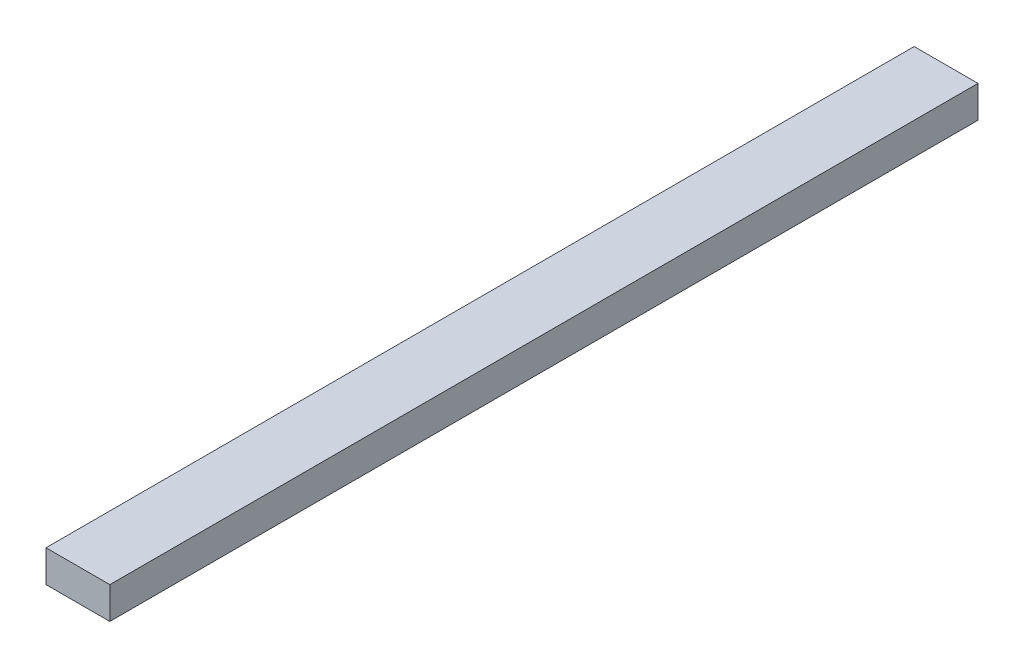
ISO-10303-21;
HEADER;
FILE_DESCRIPTION(('STEP AP214'),'2;1');
FILE_NAME('part.step','',(''),(''),'','','');
FILE_SCHEMA(('AUTOMOTIVE_DESIGN { 1 0 10303 214 1 1 1 1 }'));
ENDSEC;
DATA;
#1=APPLICATION_CONTEXT('core data for automotive mechanical design processes');
#2=APPLICATION_PROTOCOL_DEFINITION('international standard','automotive_design',2000,#1);
#3=PRODUCT_CONTEXT('',#1,'mechanical');
#4=PRODUCT('Part','Part','',(#3));
#5=PRODUCT_RELATED_PRODUCT_CATEGORY('part','',(#4));
#6=PRODUCT_DEFINITION_FORMATION('','',#4);
#7=PRODUCT_DEFINITION_CONTEXT('part definition',#1,'design');
#8=PRODUCT_DEFINITION('design','',#6,#7);
#9=PRODUCT_DEFINITION_SHAPE('','',#8);
#10=(LENGTH_UNIT() NAMED_UNIT(*) SI_UNIT(.MILLI.,.METRE.));
#11=(NAMED_UNIT(*) PLANE_ANGLE_UNIT() SI_UNIT($,.RADIAN.));
#12=(NAMED_UNIT(*) SI_UNIT($,.STERADIAN.) SOLID_ANGLE_UNIT());
#13=UNCERTAINTY_MEASURE_WITH_UNIT(LENGTH_MEASURE(1.E-05),#10,'distance_accuracy_value','');
#14=(GEOMETRIC_REPRESENTATION_CONTEXT(3) GLOBAL_UNCERTAINTY_ASSIGNED_CONTEXT((#13)) GLOBAL_UNIT_ASSIGNED_CONTEXT((#10,
#11,#12)) REPRESENTATION_CONTEXT('',''));
#15=CARTESIAN_POINT('',(0.,0.,0.));
#16=DIRECTION('',(0.,0.,1.));
#17=DIRECTION('',(1.,0.,0.));
#18=AXIS2_PLACEMENT_3D('',#15,#16,#17);
#19=CARTESIAN_POINT('',(0.,0.,172.72));
#20=DIRECTION('',(1.,0.,0.));
#21=DIRECTION('',(0.,0.,-1.));
#22=AXIS2_PLACEMENT_3D('',#19,#20,#21);
#23=PLANE('',#22);
#24=DIRECTION('',(0.,-1.,0.));
#25=VECTOR('',#24,1.);
#26=CARTESIAN_POINT('',(0.,0.,0.));
#27=LINE('',#26,#25);
#28=CARTESIAN_POINT('',(0.,6.35,0.));
#29=VERTEX_POINT('',#28);
#30=CARTESIAN_POINT('',(0.,0.,0.));
#31=VERTEX_POINT('',#30);
#32=EDGE_CURVE('E106',#29,#31,#27,.T.);
#33=ORIENTED_EDGE('',*,*,#32,.T.);
#34=DIRECTION('',(0.,0.,-1.));
#35=VECTOR('',#34,1.);
#36=CARTESIAN_POINT('',(0.,0.,172.72));
#37=LINE('',#36,#35);
#38=CARTESIAN_POINT('',(0.,0.,172.72));
#39=VERTEX_POINT('',#38);
#40=EDGE_CURVE('E11',#39,#31,#37,.T.);
#41=ORIENTED_EDGE('',*,*,#40,.F.);
#42=DIRECTION('',(0.,-1.,0.));
#43=VECTOR('',#42,1.);
#44=CARTESIAN_POINT('',(0.,0.,172.72));
#45=LINE('',#44,#43);
#46=CARTESIAN_POINT('',(0.,6.35,172.72));
#47=VERTEX_POINT('',#46);
#48=EDGE_CURVE('E94',#47,#39,#45,.T.);
#49=ORIENTED_EDGE('',*,*,#48,.F.);
#50=DIRECTION('',(0.,0.,-1.));
#51=VECTOR('',#50,1.);
#52=CARTESIAN_POINT('',(0.,6.35,172.72));
#53=LINE('',#52,#51);
#54=EDGE_CURVE('E102',#47,#29,#53,.T.);
#55=ORIENTED_EDGE('',*,*,#54,.T.);
#56=EDGE_LOOP('',(#33,#41,#49,#55));
#57=FACE_BOUND('',#56,.T.);
#58=ADVANCED_FACE('F43',(#57),#23,.F.);
#59=CARTESIAN_POINT('',(0.,0.,172.72));
#60=DIRECTION('',(0.,1.,0.));
#61=DIRECTION('',(0.,0.,1.));
#62=AXIS2_PLACEMENT_3D('',#59,#60,#61);
#63=PLANE('',#62);
#64=DIRECTION('',(1.,0.,0.));
#65=VECTOR('',#64,1.);
#66=CARTESIAN_POINT('',(0.,0.,0.));
#67=LINE('',#66,#65);
#68=CARTESIAN_POINT('',(12.7,0.,0.));
#69=VERTEX_POINT('',#68);
#70=EDGE_CURVE('E98',#31,#69,#67,.T.);
#71=ORIENTED_EDGE('',*,*,#70,.T.);
#72=DIRECTION('',(0.,0.,-1.));
#73=VECTOR('',#72,1.);
#74=CARTESIAN_POINT('',(12.7,0.,172.72));
#75=LINE('',#74,#73);
#76=CARTESIAN_POINT('',(12.7,0.,172.72));
#77=VERTEX_POINT('',#76);
#78=EDGE_CURVE('E51',#77,#69,#75,.T.);
#79=ORIENTED_EDGE('',*,*,#78,.F.);
#80=DIRECTION('',(1.,0.,0.));
#81=VECTOR('',#80,1.);
#82=CARTESIAN_POINT('',(0.,0.,172.72));
#83=LINE('',#82,#81);
#84=EDGE_CURVE('E89',#39,#77,#83,.T.);
#85=ORIENTED_EDGE('',*,*,#84,.F.);
#86=ORIENTED_EDGE('',*,*,#40,.T.);
#87=EDGE_LOOP('',(#71,#79,#85,#86));
#88=FACE_BOUND('',#87,.T.);
#89=ADVANCED_FACE('F97',(#88),#63,.F.);
#90=CARTESIAN_POINT('',(12.7,0.,172.72));
#91=DIRECTION('',(-1.,0.,0.));
#92=DIRECTION('',(0.,0.,1.));
#93=AXIS2_PLACEMENT_3D('',#90,#91,#92);
#94=PLANE('',#93);
#95=DIRECTION('',(0.,1.,0.));
#96=VECTOR('',#95,1.);
#97=CARTESIAN_POINT('',(12.7,0.,0.));
#98=LINE('',#97,#96);
#99=CARTESIAN_POINT('',(12.7,6.35,0.));
#100=VERTEX_POINT('',#99);
#101=EDGE_CURVE('E76',#69,#100,#98,.T.);
#102=ORIENTED_EDGE('',*,*,#101,.T.);
#103=DIRECTION('',(0.,0.,-1.));
#104=VECTOR('',#103,1.);
#105=CARTESIAN_POINT('',(12.7,6.35,172.72));
#106=LINE('',#105,#104);
#107=CARTESIAN_POINT('',(12.7,6.35,172.72));
#108=VERTEX_POINT('',#107);
#109=EDGE_CURVE('E99',#108,#100,#106,.T.);
#110=ORIENTED_EDGE('',*,*,#109,.F.);
#111=DIRECTION('',(0.,1.,0.));
#112=VECTOR('',#111,1.);
#113=CARTESIAN_POINT('',(12.7,0.,172.72));
#114=LINE('',#113,#112);
#115=EDGE_CURVE('E92',#77,#108,#114,.T.);
#116=ORIENTED_EDGE('',*,*,#115,.F.);
#117=ORIENTED_EDGE('',*,*,#78,.T.);
#118=EDGE_LOOP('',(#102,#110,#116,#117));
#119=FACE_BOUND('',#118,.T.);
#120=ADVANCED_FACE('F100',(#119),#94,.F.);
#121=CARTESIAN_POINT('',(0.,6.35,172.72));
#122=DIRECTION('',(0.,-1.,0.));
#123=DIRECTION('',(0.,0.,-1.));
#124=AXIS2_PLACEMENT_3D('',#121,#122,#123);
#125=PLANE('',#124);
#126=DIRECTION('',(-1.,0.,0.));
#127=VECTOR('',#126,1.);
#128=CARTESIAN_POINT('',(0.,6.35,0.));
#129=LINE('',#128,#127);
#130=EDGE_CURVE('E82',#100,#29,#129,.T.);
#131=ORIENTED_EDGE('',*,*,#130,.T.);
#132=ORIENTED_EDGE('',*,*,#54,.F.);
#133=DIRECTION('',(-1.,0.,0.));
#134=VECTOR('',#133,1.);
#135=CARTESIAN_POINT('',(0.,6.35,172.72));
#136=LINE('',#135,#134);
#137=EDGE_CURVE('E59',#108,#47,#136,.T.);
#138=ORIENTED_EDGE('',*,*,#137,.F.);
#139=ORIENTED_EDGE('',*,*,#109,.T.);
#140=EDGE_LOOP('',(#131,#132,#138,#139));
#141=FACE_BOUND('',#140,.T.);
#142=ADVANCED_FACE('F113',(#141),#125,.F.);
#143=CARTESIAN_POINT('',(0.,0.,172.72));
#144=DIRECTION('',(0.,0.,-1.));
#145=DIRECTION('',(-1.,0.,0.));
#146=AXIS2_PLACEMENT_3D('',#143,#144,#145);
#147=PLANE('',#146);
#148=ORIENTED_EDGE('',*,*,#48,.T.);
#149=ORIENTED_EDGE('',*,*,#84,.T.);
#150=ORIENTED_EDGE('',*,*,#115,.T.);
#151=ORIENTED_EDGE('',*,*,#137,.T.);
#152=EDGE_LOOP('',(#148,#149,#150,#151));
#153=FACE_BOUND('',#152,.T.);
#154=ADVANCED_FACE('F90',(#153),#147,.F.);
#155=CARTESIAN_POINT('',(0.,0.,0.));
#156=DIRECTION('',(0.,0.,-1.));
#157=DIRECTION('',(-1.,0.,0.));
#158=AXIS2_PLACEMENT_3D('',#155,#156,#157);
#159=PLANE('',#158);
#160=ORIENTED_EDGE('',*,*,#32,.F.);
#161=ORIENTED_EDGE('',*,*,#130,.F.);
#162=ORIENTED_EDGE('',*,*,#101,.F.);
#163=ORIENTED_EDGE('',*,*,#70,.F.);
#164=EDGE_LOOP('',(#160,#161,#162,#163));
#165=FACE_BOUND('',#164,.T.);
#166=ADVANCED_FACE('F116',(#165),#159,.T.);
#167=CLOSED_SHELL('',(#58,#89,#120,#142,#154,#166));
#168=MANIFOLD_SOLID_BREP('B2',#167);
#169=ADVANCED_BREP_SHAPE_REPRESENTATION('',(#18,#168),#14);
#170=SHAPE_DEFINITION_REPRESENTATION(#9,#169);
ENDSEC;
END-ISO-10303-21;
